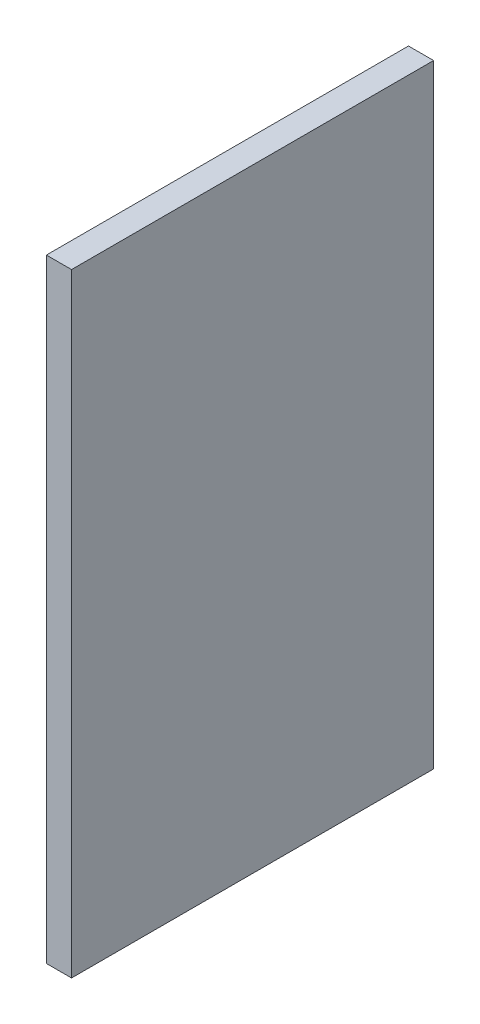
ISO-10303-21;
HEADER;
FILE_DESCRIPTION(('STEP AP214'),'2;1');
FILE_NAME('part.step','',(''),(''),'','','');
FILE_SCHEMA(('AUTOMOTIVE_DESIGN { 1 0 10303 214 1 1 1 1 }'));
ENDSEC;
DATA;
#1=APPLICATION_CONTEXT('core data for automotive mechanical design processes');
#2=APPLICATION_PROTOCOL_DEFINITION('international standard','automotive_design',2000,#1);
#3=PRODUCT_CONTEXT('',#1,'mechanical');
#4=PRODUCT('Part','Part','',(#3));
#5=PRODUCT_RELATED_PRODUCT_CATEGORY('part','',(#4));
#6=PRODUCT_DEFINITION_FORMATION('','',#4);
#7=PRODUCT_DEFINITION_CONTEXT('part definition',#1,'design');
#8=PRODUCT_DEFINITION('design','',#6,#7);
#9=PRODUCT_DEFINITION_SHAPE('','',#8);
#10=(LENGTH_UNIT() NAMED_UNIT(*) SI_UNIT(.MILLI.,.METRE.));
#11=(NAMED_UNIT(*) PLANE_ANGLE_UNIT() SI_UNIT($,.RADIAN.));
#12=(NAMED_UNIT(*) SI_UNIT($,.STERADIAN.) SOLID_ANGLE_UNIT());
#13=UNCERTAINTY_MEASURE_WITH_UNIT(LENGTH_MEASURE(1.E-05),#10,'distance_accuracy_value','');
#14=(GEOMETRIC_REPRESENTATION_CONTEXT(3) GLOBAL_UNCERTAINTY_ASSIGNED_CONTEXT((#13)) GLOBAL_UNIT_ASSIGNED_CONTEXT((#10,
#11,#12)) REPRESENTATION_CONTEXT('',''));
#15=CARTESIAN_POINT('',(0.,0.,0.));
#16=DIRECTION('',(0.,0.,1.));
#17=DIRECTION('',(1.,0.,0.));
#18=AXIS2_PLACEMENT_3D('',#15,#16,#17);
#19=CARTESIAN_POINT('',(-117.6,-98.0000000000001,-259.8));
#20=DIRECTION('',(-1.,0.,0.));
#21=DIRECTION('',(0.,-1.,0.));
#22=AXIS2_PLACEMENT_3D('',#19,#20,#21);
#23=PLANE('',#22);
#24=DIRECTION('',(0.,1.,0.));
#25=VECTOR('',#24,1.);
#26=CARTESIAN_POINT('',(-117.6,-98.0000000000001,-331.8));
#27=LINE('',#26,#25);
#28=CARTESIAN_POINT('',(-117.6,-220.,-331.8));
#29=VERTEX_POINT('',#28);
#30=CARTESIAN_POINT('',(-117.6,-98.0000000000001,-331.8));
#31=VERTEX_POINT('',#30);
#32=EDGE_CURVE('E96',#29,#31,#27,.T.);
#33=ORIENTED_EDGE('',*,*,#32,.T.);
#34=DIRECTION('',(0.,0.,-1.));
#35=VECTOR('',#34,1.);
#36=CARTESIAN_POINT('',(-117.6,-98.0000000000001,-259.8));
#37=LINE('',#36,#35);
#38=CARTESIAN_POINT('',(-117.6,-98.0000000000001,-259.8));
#39=VERTEX_POINT('',#38);
#40=EDGE_CURVE('E11',#39,#31,#37,.T.);
#41=ORIENTED_EDGE('',*,*,#40,.F.);
#42=DIRECTION('',(0.,1.,0.));
#43=VECTOR('',#42,1.);
#44=CARTESIAN_POINT('',(-117.6,-98.0000000000001,-259.8));
#45=LINE('',#44,#43);
#46=CARTESIAN_POINT('',(-117.6,-220.,-259.8));
#47=VERTEX_POINT('',#46);
#48=EDGE_CURVE('E84',#47,#39,#45,.T.);
#49=ORIENTED_EDGE('',*,*,#48,.F.);
#50=DIRECTION('',(0.,0.,-1.));
#51=VECTOR('',#50,1.);
#52=CARTESIAN_POINT('',(-117.6,-220.,-259.8));
#53=LINE('',#52,#51);
#54=EDGE_CURVE('E92',#47,#29,#53,.T.);
#55=ORIENTED_EDGE('',*,*,#54,.T.);
#56=EDGE_LOOP('',(#33,#41,#49,#55));
#57=FACE_BOUND('',#56,.T.);
#58=ADVANCED_FACE('F33',(#57),#23,.F.);
#59=CARTESIAN_POINT('',(-117.6,-98.0000000000001,-259.8));
#60=DIRECTION('',(0.,-1.,0.));
#61=DIRECTION('',(0.,0.,-1.));
#62=AXIS2_PLACEMENT_3D('',#59,#60,#61);
#63=PLANE('',#62);
#64=DIRECTION('',(-1.,0.,0.));
#65=VECTOR('',#64,1.);
#66=CARTESIAN_POINT('',(-117.6,-98.0000000000001,-331.8));
#67=LINE('',#66,#65);
#68=CARTESIAN_POINT('',(-122.6,-98.0000000000001,-331.8));
#69=VERTEX_POINT('',#68);
#70=EDGE_CURVE('E88',#31,#69,#67,.T.);
#71=ORIENTED_EDGE('',*,*,#70,.T.);
#72=DIRECTION('',(0.,0.,-1.));
#73=VECTOR('',#72,1.);
#74=CARTESIAN_POINT('',(-122.6,-98.0000000000001,-259.8));
#75=LINE('',#74,#73);
#76=CARTESIAN_POINT('',(-122.6,-98.0000000000001,-259.8));
#77=VERTEX_POINT('',#76);
#78=EDGE_CURVE('E41',#77,#69,#75,.T.);
#79=ORIENTED_EDGE('',*,*,#78,.F.);
#80=DIRECTION('',(-1.,0.,0.));
#81=VECTOR('',#80,1.);
#82=CARTESIAN_POINT('',(-117.6,-98.0000000000001,-259.8));
#83=LINE('',#82,#81);
#84=EDGE_CURVE('E79',#39,#77,#83,.T.);
#85=ORIENTED_EDGE('',*,*,#84,.F.);
#86=ORIENTED_EDGE('',*,*,#40,.T.);
#87=EDGE_LOOP('',(#71,#79,#85,#86));
#88=FACE_BOUND('',#87,.T.);
#89=ADVANCED_FACE('F87',(#88),#63,.F.);
#90=CARTESIAN_POINT('',(-122.6,-98.0000000000001,-259.8));
#91=DIRECTION('',(1.,0.,0.));
#92=DIRECTION('',(0.,1.,0.));
#93=AXIS2_PLACEMENT_3D('',#90,#91,#92);
#94=PLANE('',#93);
#95=DIRECTION('',(0.,-1.,0.));
#96=VECTOR('',#95,1.);
#97=CARTESIAN_POINT('',(-122.6,-98.0000000000001,-331.8));
#98=LINE('',#97,#96);
#99=CARTESIAN_POINT('',(-122.6,-220.,-331.8));
#100=VERTEX_POINT('',#99);
#101=EDGE_CURVE('E66',#69,#100,#98,.T.);
#102=ORIENTED_EDGE('',*,*,#101,.T.);
#103=DIRECTION('',(0.,0.,-1.));
#104=VECTOR('',#103,1.);
#105=CARTESIAN_POINT('',(-122.6,-220.,-259.8));
#106=LINE('',#105,#104);
#107=CARTESIAN_POINT('',(-122.6,-220.,-259.8));
#108=VERTEX_POINT('',#107);
#109=EDGE_CURVE('E89',#108,#100,#106,.T.);
#110=ORIENTED_EDGE('',*,*,#109,.F.);
#111=DIRECTION('',(0.,-1.,0.));
#112=VECTOR('',#111,1.);
#113=CARTESIAN_POINT('',(-122.6,-98.0000000000001,-259.8));
#114=LINE('',#113,#112);
#115=EDGE_CURVE('E82',#77,#108,#114,.T.);
#116=ORIENTED_EDGE('',*,*,#115,.F.);
#117=ORIENTED_EDGE('',*,*,#78,.T.);
#118=EDGE_LOOP('',(#102,#110,#116,#117));
#119=FACE_BOUND('',#118,.T.);
#120=ADVANCED_FACE('F90',(#119),#94,.F.);
#121=CARTESIAN_POINT('',(-117.6,-220.,-259.8));
#122=DIRECTION('',(0.,1.,0.));
#123=DIRECTION('',(0.,0.,1.));
#124=AXIS2_PLACEMENT_3D('',#121,#122,#123);
#125=PLANE('',#124);
#126=DIRECTION('',(1.,0.,0.));
#127=VECTOR('',#126,1.);
#128=CARTESIAN_POINT('',(-117.6,-220.,-331.8));
#129=LINE('',#128,#127);
#130=EDGE_CURVE('E72',#100,#29,#129,.T.);
#131=ORIENTED_EDGE('',*,*,#130,.T.);
#132=ORIENTED_EDGE('',*,*,#54,.F.);
#133=DIRECTION('',(1.,0.,0.));
#134=VECTOR('',#133,1.);
#135=CARTESIAN_POINT('',(-117.6,-220.,-259.8));
#136=LINE('',#135,#134);
#137=EDGE_CURVE('E49',#108,#47,#136,.T.);
#138=ORIENTED_EDGE('',*,*,#137,.F.);
#139=ORIENTED_EDGE('',*,*,#109,.T.);
#140=EDGE_LOOP('',(#131,#132,#138,#139));
#141=FACE_BOUND('',#140,.T.);
#142=ADVANCED_FACE('F103',(#141),#125,.F.);
#143=CARTESIAN_POINT('',(0.,0.,-259.8));
#144=DIRECTION('',(0.,0.,-1.));
#145=DIRECTION('',(-1.,0.,0.));
#146=AXIS2_PLACEMENT_3D('',#143,#144,#145);
#147=PLANE('',#146);
#148=ORIENTED_EDGE('',*,*,#48,.T.);
#149=ORIENTED_EDGE('',*,*,#84,.T.);
#150=ORIENTED_EDGE('',*,*,#115,.T.);
#151=ORIENTED_EDGE('',*,*,#137,.T.);
#152=EDGE_LOOP('',(#148,#149,#150,#151));
#153=FACE_BOUND('',#152,.T.);
#154=ADVANCED_FACE('F80',(#153),#147,.F.);
#155=CARTESIAN_POINT('',(0.,0.,-331.8));
#156=DIRECTION('',(0.,0.,-1.));
#157=DIRECTION('',(-1.,0.,0.));
#158=AXIS2_PLACEMENT_3D('',#155,#156,#157);
#159=PLANE('',#158);
#160=ORIENTED_EDGE('',*,*,#32,.F.);
#161=ORIENTED_EDGE('',*,*,#130,.F.);
#162=ORIENTED_EDGE('',*,*,#101,.F.);
#163=ORIENTED_EDGE('',*,*,#70,.F.);
#164=EDGE_LOOP('',(#160,#161,#162,#163));
#165=FACE_BOUND('',#164,.T.);
#166=ADVANCED_FACE('F106',(#165),#159,.T.);
#167=CLOSED_SHELL('',(#58,#89,#120,#142,#154,#166));
#168=MANIFOLD_SOLID_BREP('B2',#167);
#169=ADVANCED_BREP_SHAPE_REPRESENTATION('',(#18,#168),#14);
#170=SHAPE_DEFINITION_REPRESENTATION(#9,#169);
ENDSEC;
END-ISO-10303-21;
